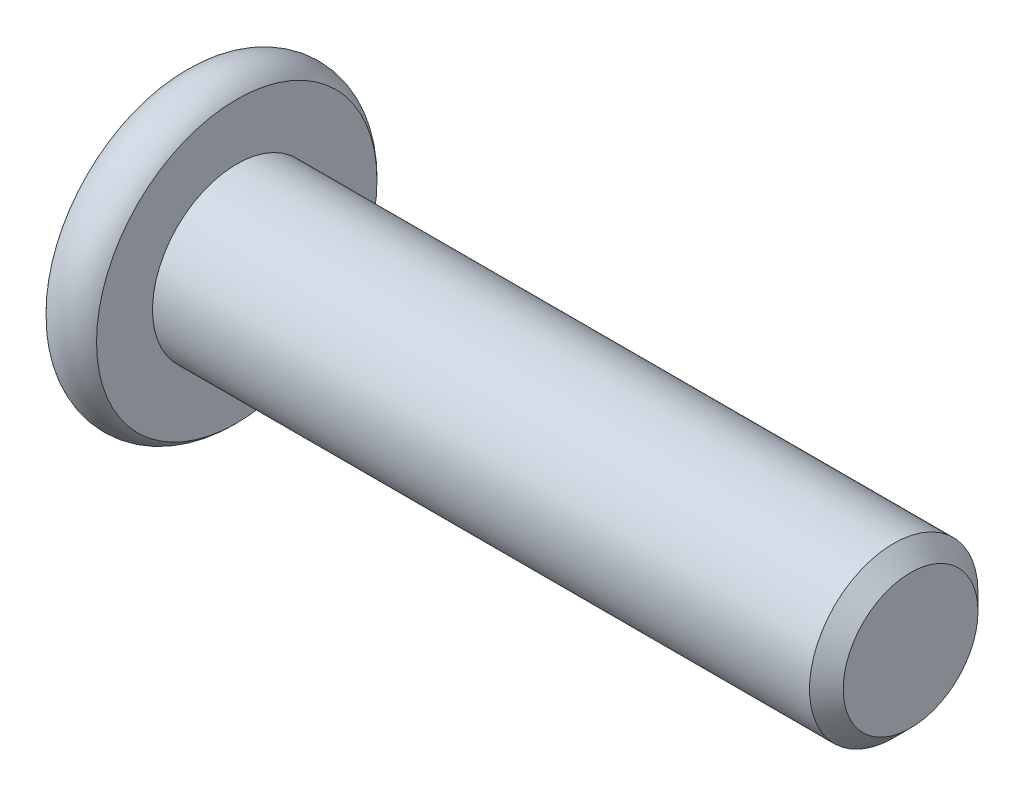
ISO-10303-21;
HEADER;
FILE_DESCRIPTION(('STEP AP214'),'2;1');
FILE_NAME('part.step','',(''),(''),'','','');
FILE_SCHEMA(('AUTOMOTIVE_DESIGN { 1 0 10303 214 1 1 1 1 }'));
ENDSEC;
DATA;
#1=APPLICATION_CONTEXT('core data for automotive mechanical design processes');
#2=APPLICATION_PROTOCOL_DEFINITION('international standard','automotive_design',2000,#1);
#3=PRODUCT_CONTEXT('',#1,'mechanical');
#4=PRODUCT('Part','Part','',(#3));
#5=PRODUCT_RELATED_PRODUCT_CATEGORY('part','',(#4));
#6=PRODUCT_DEFINITION_FORMATION('','',#4);
#7=PRODUCT_DEFINITION_CONTEXT('part definition',#1,'design');
#8=PRODUCT_DEFINITION('design','',#6,#7);
#9=PRODUCT_DEFINITION_SHAPE('','',#8);
#10=(LENGTH_UNIT() NAMED_UNIT(*) SI_UNIT(.MILLI.,.METRE.));
#11=(NAMED_UNIT(*) PLANE_ANGLE_UNIT() SI_UNIT($,.RADIAN.));
#12=(NAMED_UNIT(*) SI_UNIT($,.STERADIAN.) SOLID_ANGLE_UNIT());
#13=UNCERTAINTY_MEASURE_WITH_UNIT(LENGTH_MEASURE(1.E-05),#10,'distance_accuracy_value','');
#14=(GEOMETRIC_REPRESENTATION_CONTEXT(3) GLOBAL_UNCERTAINTY_ASSIGNED_CONTEXT((#13)) GLOBAL_UNIT_ASSIGNED_CONTEXT((#10,
#11,#12)) REPRESENTATION_CONTEXT('',''));
#15=CARTESIAN_POINT('',(0.,0.,0.));
#16=DIRECTION('',(0.,0.,1.));
#17=DIRECTION('',(1.,0.,0.));
#18=AXIS2_PLACEMENT_3D('',#15,#16,#17);
#19=CARTESIAN_POINT('',(-20.,0.,0.));
#20=DIRECTION('',(1.,0.,0.));
#21=DIRECTION('',(0.,0.,-1.));
#22=AXIS2_PLACEMENT_3D('',#19,#20,#21);
#23=CYLINDRICAL_SURFACE('',#22,2.5);
#24=CARTESIAN_POINT('',(-0.5,0.,0.));
#25=DIRECTION('',(1.,0.,0.));
#26=DIRECTION('',(0.,0.,-1.));
#27=AXIS2_PLACEMENT_3D('',#24,#25,#26);
#28=CIRCLE('',#27,2.5);
#29=CARTESIAN_POINT('',(-0.5,0.,-2.5));
#30=VERTEX_POINT('',#29);
#31=EDGE_CURVE('E46',#30,#30,#28,.F.);
#32=ORIENTED_EDGE('',*,*,#31,.T.);
#33=EDGE_LOOP('',(#32));
#34=FACE_BOUND('',#33,.T.);
#35=CARTESIAN_POINT('',(-20.,0.,0.));
#36=DIRECTION('',(-1.,0.,0.));
#37=DIRECTION('',(0.,-1.,0.));
#38=AXIS2_PLACEMENT_3D('',#35,#36,#37);
#39=CIRCLE('',#38,2.5);
#40=CARTESIAN_POINT('',(-20.,-2.50000000000001,0.));
#41=VERTEX_POINT('',#40);
#42=EDGE_CURVE('E122',#41,#41,#39,.F.);
#43=ORIENTED_EDGE('',*,*,#42,.T.);
#44=EDGE_LOOP('',(#43));
#45=FACE_BOUND('',#44,.T.);
#46=ADVANCED_FACE('F33',(#34,#45),#23,.T.);
#47=CARTESIAN_POINT('',(0.,0.,0.));
#48=DIRECTION('',(1.,0.,0.));
#49=DIRECTION('',(0.,0.,-1.));
#50=AXIS2_PLACEMENT_3D('',#47,#48,#49);
#51=PLANE('',#50);
#52=CARTESIAN_POINT('',(0.,0.,0.));
#53=DIRECTION('',(1.,0.,0.));
#54=DIRECTION('',(0.,0.,-1.));
#55=AXIS2_PLACEMENT_3D('',#52,#53,#54);
#56=CIRCLE('',#55,2.);
#57=CARTESIAN_POINT('',(0.,0.,-2.));
#58=VERTEX_POINT('',#57);
#59=EDGE_CURVE('E125',#58,#58,#56,.T.);
#60=ORIENTED_EDGE('',*,*,#59,.T.);
#61=EDGE_LOOP('',(#60));
#62=FACE_BOUND('',#61,.T.);
#63=ADVANCED_FACE('F135',(#62),#51,.T.);
#64=CARTESIAN_POINT('',(0.,0.,0.));
#65=DIRECTION('',(-1.,0.,0.));
#66=DIRECTION('',(0.,0.,1.));
#67=AXIS2_PLACEMENT_3D('',#64,#65,#66);
#68=CONICAL_SURFACE('',#67,2.,0.785398163397446);
#69=ORIENTED_EDGE('',*,*,#31,.F.);
#70=EDGE_LOOP('',(#69));
#71=FACE_BOUND('',#70,.T.);
#72=ORIENTED_EDGE('',*,*,#59,.F.);
#73=EDGE_LOOP('',(#72));
#74=FACE_BOUND('',#73,.T.);
#75=ADVANCED_FACE('F35',(#71,#74),#68,.T.);
#76=CARTESIAN_POINT('',(-21.5,0.,0.));
#77=DIRECTION('',(1.,0.,0.));
#78=DIRECTION('',(0.,1.,0.));
#79=AXIS2_PLACEMENT_3D('',#76,#77,#78);
#80=PLANE('',#79);
#81=CARTESIAN_POINT('',(-21.5,0.,0.));
#82=DIRECTION('',(-1.,0.,0.));
#83=DIRECTION('',(0.,-1.,0.));
#84=AXIS2_PLACEMENT_3D('',#81,#82,#83);
#85=CIRCLE('',#84,1.78205080756886);
#86=CARTESIAN_POINT('',(-21.5,-1.78205080756877,0.));
#87=VERTEX_POINT('',#86);
#88=EDGE_CURVE('E235',#87,#87,#85,.T.);
#89=ORIENTED_EDGE('',*,*,#88,.F.);
#90=EDGE_LOOP('',(#89));
#91=FACE_BOUND('',#90,.T.);
#92=CARTESIAN_POINT('',(-21.5,0.,0.));
#93=DIRECTION('',(-1.,0.,0.));
#94=DIRECTION('',(0.,-1.,0.));
#95=AXIS2_PLACEMENT_3D('',#92,#93,#94);
#96=CIRCLE('',#95,4.16143782776615);
#97=CARTESIAN_POINT('',(-21.5,-4.16143782776614,0.));
#98=VERTEX_POINT('',#97);
#99=EDGE_CURVE('E119',#98,#98,#96,.T.);
#100=ORIENTED_EDGE('',*,*,#99,.T.);
#101=EDGE_LOOP('',(#100));
#102=FACE_BOUND('',#101,.T.);
#103=ADVANCED_FACE('F134',(#91,#102),#80,.F.);
#104=CARTESIAN_POINT('',(-20.75,0.,0.));
#105=DIRECTION('',(-1.,0.,0.));
#106=DIRECTION('',(0.,-1.,0.));
#107=AXIS2_PLACEMENT_3D('',#104,#105,#106);
#108=TOROIDAL_SURFACE('',#107,3.5,1.);
#109=ORIENTED_EDGE('',*,*,#99,.F.);
#110=EDGE_LOOP('',(#109));
#111=FACE_BOUND('',#110,.T.);
#112=CARTESIAN_POINT('',(-20.,0.,0.));
#113=DIRECTION('',(-1.,0.,0.));
#114=DIRECTION('',(0.,-1.,0.));
#115=AXIS2_PLACEMENT_3D('',#112,#113,#114);
#116=CIRCLE('',#115,4.16143782776615);
#117=CARTESIAN_POINT('',(-20.,-4.16143782776615,0.));
#118=VERTEX_POINT('',#117);
#119=EDGE_CURVE('E116',#118,#118,#116,.T.);
#120=ORIENTED_EDGE('',*,*,#119,.T.);
#121=EDGE_LOOP('',(#120));
#122=FACE_BOUND('',#121,.T.);
#123=ADVANCED_FACE('F146',(#111,#122),#108,.T.);
#124=CARTESIAN_POINT('',(-20.,4.16143782776615,0.));
#125=DIRECTION('',(-1.,0.,0.));
#126=DIRECTION('',(0.,-1.,0.));
#127=AXIS2_PLACEMENT_3D('',#124,#125,#126);
#128=PLANE('',#127);
#129=ORIENTED_EDGE('',*,*,#42,.F.);
#130=EDGE_LOOP('',(#129));
#131=FACE_BOUND('',#130,.T.);
#132=ORIENTED_EDGE('',*,*,#119,.F.);
#133=EDGE_LOOP('',(#132));
#134=FACE_BOUND('',#133,.T.);
#135=ADVANCED_FACE('F150',(#131,#134),#128,.F.);
#136=CARTESIAN_POINT('',(-21.5,0.,0.));
#137=DIRECTION('',(-1.,0.,0.));
#138=DIRECTION('',(0.,-1.,0.));
#139=AXIS2_PLACEMENT_3D('',#136,#137,#138);
#140=CONICAL_SURFACE('',#139,1.78205080756886,0.78539816339745);
#141=ORIENTED_EDGE('',*,*,#88,.T.);
#142=EDGE_LOOP('',(#141));
#143=FACE_BOUND('',#142,.T.);
#144=CARTESIAN_POINT('',(-22.015428085613,-1.74023253176573,1.5));
#145=CARTESIAN_POINT('',(-21.9833811073445,-1.69791724929727,1.5));
#146=CARTESIAN_POINT('',(-21.9516444672841,-1.65536760966788,1.5));
#147=CARTESIAN_POINT('',(-21.8889203936153,-1.56970398156681,1.5));
#148=CARTESIAN_POINT('',(-21.85793314822,-1.52658985542845,1.5));
#149=CARTESIAN_POINT('',(-21.765846164345,-1.39562626326559,1.5));
#150=CARTESIAN_POINT('',(-21.7061145123021,-1.30679868010572,1.5));
#151=CARTESIAN_POINT('',(-21.5887342891012,-1.12044622640211,1.5));
#152=CARTESIAN_POINT('',(-21.5314082774823,-1.02271587306669,1.5));
#153=CARTESIAN_POINT('',(-21.426463214976,-0.822357214965219,1.5));
#154=CARTESIAN_POINT('',(-21.3788114236896,-0.719746931701882,1.5));
#155=CARTESIAN_POINT('',(-21.320509988315,-0.565852387095054,1.5));
#156=CARTESIAN_POINT('',(-21.3037990535409,-0.516874191424642,1.5));
#157=CARTESIAN_POINT('',(-21.2743077515089,-0.41772398845748,1.5));
#158=CARTESIAN_POINT('',(-21.2615276514219,-0.367551900263847,1.5));
#159=CARTESIAN_POINT('',(-21.2407784202458,-0.267158299056097,1.5));
#160=CARTESIAN_POINT('',(-21.2327260618259,-0.216954261864833,1.5));
#161=CARTESIAN_POINT('',(-21.221591636834,-0.115994915871297,1.5));
#162=CARTESIAN_POINT('',(-21.2185086886377,-0.0652397064615148,1.5));
#163=CARTESIAN_POINT('',(-21.2175473897404,0.0344222234875812,1.5));
#164=CARTESIAN_POINT('',(-21.2194789216952,0.0833271701101152,1.5));
#165=CARTESIAN_POINT('',(-21.2280175729677,0.180724293127248,1.5));
#166=CARTESIAN_POINT('',(-21.234625142048,0.229216429361756,1.5));
#167=CARTESIAN_POINT('',(-21.2522650626447,0.326258027697034,1.5));
#168=CARTESIAN_POINT('',(-21.263373168201,0.374793507450053,1.5));
#169=CARTESIAN_POINT('',(-21.2894198669595,0.470802295834207,1.5));
#170=CARTESIAN_POINT('',(-21.3043581560035,0.518275688481311,1.5));
#171=CARTESIAN_POINT('',(-21.356839545716,0.667150562065161,1.5));
#172=CARTESIAN_POINT('',(-21.4003351165442,0.766448362426881,1.5));
#173=CARTESIAN_POINT('',(-21.4970587814836,0.960384405673869,1.5));
#174=CARTESIAN_POINT('',(-21.5503217226675,1.05500437383624,1.5));
#175=CARTESIAN_POINT('',(-21.6602258010453,1.23584520321535,1.5));
#176=CARTESIAN_POINT('',(-21.7165682531046,1.32224986946553,1.5));
#177=CARTESIAN_POINT('',(-21.803675572597,1.44954953726477,1.5));
#178=CARTESIAN_POINT('',(-21.8330199906839,1.49143368482427,1.5));
#179=CARTESIAN_POINT('',(-21.8924869182931,1.57462914783248,1.5));
#180=CARTESIAN_POINT('',(-21.9226092115007,1.61594061772583,1.5));
#181=CARTESIAN_POINT('',(-21.9530541181366,1.65701358742556,1.5));
#182=B_SPLINE_CURVE_WITH_KNOTS('',3,(#144,#145,#146,#147,#148,#149,#150,#151,#152,#153,#154,
#155,#156,#157,#158,#159,#160,#161,#162,#163,#164,#165,#166,#167,#168,#169,#170,#171,#172,#173,
#174,#175,#176,#177,#178,#179,#180,#181),.UNSPECIFIED.,.F.,.F.,(4,2,2,2,2,2,2,2,2,2,2,2,2,2,2,2,
2,2,4),(0.,0.159238974218354,0.318517535014543,0.639504781932386,0.979137893799193,
1.31760168934357,1.47272233841624,1.62785352839775,1.78016486537346,1.93244917778279,
2.07904486260297,2.22565464958332,2.37484213303399,2.52401777304039,2.84828365283775,
3.1737297566675,3.48303030530537,3.63644667013909,3.78982082222913),.UNSPECIFIED.);
#183=CARTESIAN_POINT('',(-21.45,-0.866025403784357,1.5));
#184=VERTEX_POINT('',#183);
#185=CARTESIAN_POINT('',(-21.45,0.866025403784521,1.5));
#186=VERTEX_POINT('',#185);
#187=EDGE_CURVE('E100',#184,#186,#182,.T.);
#188=ORIENTED_EDGE('',*,*,#187,.F.);
#189=CARTESIAN_POINT('',(-21.4501154816001,-1.73216627762263,-0.0002000000000008));
#190=CARTESIAN_POINT('',(-21.4203654760674,-1.70239359975907,0.0513677907370744));
#191=CARTESIAN_POINT('',(-21.3923624839103,-1.67212305186347,0.103797917665199));
#192=CARTESIAN_POINT('',(-21.3410892304402,-1.61039789003611,0.210709034055595));
#193=CARTESIAN_POINT('',(-21.3178475050444,-1.57893740312606,0.26520019581466));
#194=CARTESIAN_POINT('',(-21.2780337289922,-1.51549879897979,0.375079081357248));
#195=CARTESIAN_POINT('',(-21.2613615856709,-1.48353684526802,0.430438809095199));
#196=CARTESIAN_POINT('',(-21.2356744568181,-1.41890915196203,0.54237725747715));
#197=CARTESIAN_POINT('',(-21.2266402904789,-1.3862453878111,0.598952556553009));
#198=CARTESIAN_POINT('',(-21.2184890812269,-1.32995210095291,0.696455389516442));
#199=CARTESIAN_POINT('',(-21.2172822529892,-1.30639533311116,0.737256908280467));
#200=CARTESIAN_POINT('',(-21.2193140571623,-1.25932335290185,0.818787969615859));
#201=CARTESIAN_POINT('',(-21.2225536707483,-1.23580815085305,0.859517494314631));
#202=CARTESIAN_POINT('',(-21.233291985982,-1.18900414978418,0.940584402163417));
#203=CARTESIAN_POINT('',(-21.2407946530188,-1.16571558211711,0.980921384598289));
#204=CARTESIAN_POINT('',(-21.2596516119283,-1.11952932016327,1.06091833691403));
#205=CARTESIAN_POINT('',(-21.2710075570186,-1.09663179808778,1.10057800851621));
#206=CARTESIAN_POINT('',(-21.3047216475927,-1.0379815980969,1.20216313477449));
#207=CARTESIAN_POINT('',(-21.3296218490934,-1.00259267147457,1.26345855370969));
#208=CARTESIAN_POINT('',(-21.3716566532716,-0.950557780604292,1.35358562846331));
#209=CARTESIAN_POINT('',(-21.3864251535591,-0.933410759677065,1.38328513990772));
#210=CARTESIAN_POINT('',(-21.4173105659402,-0.899432101996325,1.44213790138375));
#211=CARTESIAN_POINT('',(-21.4334268341217,-0.882600319285629,1.47129140422064));
#212=CARTESIAN_POINT('',(-21.4501154816001,-0.865909933730519,1.5002));
#213=B_SPLINE_CURVE_WITH_KNOTS('',3,(#189,#190,#191,#192,#193,#194,#195,#196,#197,#198,#199,
#200,#201,#202,#203,#204,#205,#206,#207,#208,#209,#210,#211,#212),.UNSPECIFIED.,.F.,.F.,(4,2,2,
2,2,2,2,2,2,2,2,4),(0.,0.199829143693305,0.400822987382389,0.598623720538181,0.795926240188891,
0.937113067959883,1.07833105577193,1.21968061668222,1.36109089931055,1.58570969637566,
1.69770705470964,1.80965120737194),.UNSPECIFIED.);
#214=CARTESIAN_POINT('',(-21.45,-1.73205080756879,0.));
#215=VERTEX_POINT('',#214);
#216=EDGE_CURVE('E192',#215,#184,#213,.T.);
#217=ORIENTED_EDGE('',*,*,#216,.F.);
#218=CARTESIAN_POINT('',(-21.4501154816001,-0.865909933730519,-1.5002));
#219=CARTESIAN_POINT('',(-21.4203654760674,-0.895682611594084,-1.44863220926292));
#220=CARTESIAN_POINT('',(-21.3923624839103,-0.925953159489683,-1.3962020823348));
#221=CARTESIAN_POINT('',(-21.3410892304402,-0.987678321317041,-1.2892909659444));
#222=CARTESIAN_POINT('',(-21.3178475050444,-1.01913880822709,-1.23479980418534));
#223=CARTESIAN_POINT('',(-21.2780337289922,-1.08257741237336,-1.12492091864275));
#224=CARTESIAN_POINT('',(-21.2613615856709,-1.11453936608513,-1.0695611909048));
#225=CARTESIAN_POINT('',(-21.2356744568181,-1.17916705939112,-0.957622742522851));
#226=CARTESIAN_POINT('',(-21.2266402904789,-1.21183082354205,-0.901047443446993));
#227=CARTESIAN_POINT('',(-21.2184890812269,-1.26812411040024,-0.80354461048356));
#228=CARTESIAN_POINT('',(-21.2172822529892,-1.291680878242,-0.762743091719535));
#229=CARTESIAN_POINT('',(-21.2193140571623,-1.3387528584513,-0.681212030384143));
#230=CARTESIAN_POINT('',(-21.2225536707483,-1.3622680605001,-0.640482505685371));
#231=CARTESIAN_POINT('',(-21.233291985982,-1.40907206156897,-0.559415597836585));
#232=CARTESIAN_POINT('',(-21.2407946530188,-1.43236062923604,-0.519078615401714));
#233=CARTESIAN_POINT('',(-21.2596516119283,-1.47854689118988,-0.439081663085971));
#234=CARTESIAN_POINT('',(-21.2710075570186,-1.50144441326537,-0.399421991483794));
#235=CARTESIAN_POINT('',(-21.3047216475927,-1.56009461325625,-0.297836865225517));
#236=CARTESIAN_POINT('',(-21.3296218490934,-1.59548353987858,-0.236541446290313));
#237=CARTESIAN_POINT('',(-21.3716566532716,-1.64751843074886,-0.146414371536688));
#238=CARTESIAN_POINT('',(-21.3864251535591,-1.66466545167609,-0.116714860092285));
#239=CARTESIAN_POINT('',(-21.4173105659402,-1.69864410935683,-0.0578620986162509));
#240=CARTESIAN_POINT('',(-21.4334268341217,-1.71547589206752,-0.0287085957793639));
#241=CARTESIAN_POINT('',(-21.4501154816001,-1.73216627762263,0.00019999999999943));
#242=B_SPLINE_CURVE_WITH_KNOTS('',3,(#218,#219,#220,#221,#222,#223,#224,#225,#226,#227,#228,
#229,#230,#231,#232,#233,#234,#235,#236,#237,#238,#239,#240,#241),.UNSPECIFIED.,.F.,.F.,(4,2,2,
2,2,2,2,2,2,2,2,4),(0.,0.199829143693304,0.400822987382386,0.598623720538178,0.795926240188888,
0.937113067959879,1.07833105577193,1.21968061668222,1.36109089931054,1.58570969637565,
1.69770705470963,1.80965120737194),.UNSPECIFIED.);
#243=CARTESIAN_POINT('',(-21.45,-0.866025403784356,-1.5));
#244=VERTEX_POINT('',#243);
#245=EDGE_CURVE('E187',#244,#215,#242,.T.);
#246=ORIENTED_EDGE('',*,*,#245,.F.);
#247=CARTESIAN_POINT('',(-22.0154280857208,-1.74023253190806,-1.5));
#248=CARTESIAN_POINT('',(-21.9833811074482,-1.69791724943558,-1.5));
#249=CARTESIAN_POINT('',(-21.9516444673836,-1.65536760980217,-1.5));
#250=CARTESIAN_POINT('',(-21.8889203937065,-1.569703981693,-1.5));
#251=CARTESIAN_POINT('',(-21.8579331483071,-1.52658985555058,-1.5));
#252=CARTESIAN_POINT('',(-21.7658461644196,-1.39562626337528,-1.5));
#253=CARTESIAN_POINT('',(-21.7061145123685,-1.30679868020694,-1.5));
#254=CARTESIAN_POINT('',(-21.5887342891506,-1.12044622648488,-1.5));
#255=CARTESIAN_POINT('',(-21.5314082775229,-1.02271587313942,-1.5));
#256=CARTESIAN_POINT('',(-21.4264632150005,-0.822357215017008,-1.5));
#257=CARTESIAN_POINT('',(-21.3788114237068,-0.719746931742781,-1.5));
#258=CARTESIAN_POINT('',(-21.3205099883267,-0.565852387127772,-1.5));
#259=CARTESIAN_POINT('',(-21.3037990535528,-0.516874191460807,-1.5));
#260=CARTESIAN_POINT('',(-21.2743077515206,-0.417723988500656,-1.5));
#261=CARTESIAN_POINT('',(-21.2615276514332,-0.367551900310585,-1.5));
#262=CARTESIAN_POINT('',(-21.2407784202553,-0.267158299109846,-1.5));
#263=CARTESIAN_POINT('',(-21.2327260618343,-0.216954261922027,-1.5));
#264=CARTESIAN_POINT('',(-21.2215916368391,-0.11599491593527,-1.5));
#265=CARTESIAN_POINT('',(-21.2185086886407,-0.0652397065288216,-1.5));
#266=CARTESIAN_POINT('',(-21.2175473897388,0.0344222234142057,-1.5));
#267=CARTESIAN_POINT('',(-21.219478921691,0.0833271700339959,-1.5));
#268=CARTESIAN_POINT('',(-21.228017572958,0.18072429304592,-1.5));
#269=CARTESIAN_POINT('',(-21.2346251420354,0.229216429277964,-1.5));
#270=CARTESIAN_POINT('',(-21.2522650626259,0.326258027608378,-1.5));
#271=CARTESIAN_POINT('',(-21.2633731681789,0.374793507359005,-1.5));
#272=CARTESIAN_POINT('',(-21.2894198669309,0.470802295738608,-1.5));
#273=CARTESIAN_POINT('',(-21.3043581559716,0.518275688383553,-1.5));
#274=CARTESIAN_POINT('',(-21.3568395456685,0.667150561946207,-1.5));
#275=CARTESIAN_POINT('',(-21.4003351164824,0.766448362289951,-1.5));
#276=CARTESIAN_POINT('',(-21.4970587813916,0.960384405502367,-1.5));
#277=CARTESIAN_POINT('',(-21.5503217225595,1.05500437364815,-1.5));
#278=CARTESIAN_POINT('',(-21.6602258009069,1.23584520299745,-1.5));
#279=CARTESIAN_POINT('',(-21.7165682529518,1.32224986923429,-1.5));
#280=CARTESIAN_POINT('',(-21.8036755724226,1.44954953701381,-1.5));
#281=CARTESIAN_POINT('',(-21.8330199905024,1.49143368456684,-1.5));
#282=CARTESIAN_POINT('',(-21.8924869180973,1.57462914756214,-1.5));
#283=CARTESIAN_POINT('',(-21.9226092112979,1.61594061744905,-1.5));
#284=CARTESIAN_POINT('',(-21.9530541179266,1.65701358714236,-1.5));
#285=B_SPLINE_CURVE_WITH_KNOTS('',3,(#247,#248,#249,#250,#251,#252,#253,#254,#255,#256,#257,
#258,#259,#260,#261,#262,#263,#264,#265,#266,#267,#268,#269,#270,#271,#272,#273,#274,#275,#276,
#277,#278,#279,#280,#281,#282,#283,#284),.UNSPECIFIED.,.F.,.F.,(4,2,2,2,2,2,2,2,2,2,2,2,2,2,2,2,
2,2,4),(0.,0.159238974235481,0.318517535048797,0.63950478200154,0.979137893907506,
1.31760168949067,1.47272233855334,1.62785352852489,1.78016486549104,1.93244917789081,
2.0790448627025,2.22565464967435,2.37484213311584,2.52401777311309,2.8482836528441,
3.17372975660706,3.4830303051878,3.63644666999334,3.78982082205521),.UNSPECIFIED.);
#286=CARTESIAN_POINT('',(-21.45,0.866025403784521,-1.5));
#287=VERTEX_POINT('',#286);
#288=EDGE_CURVE('E53',#287,#244,#285,.F.);
#289=ORIENTED_EDGE('',*,*,#288,.F.);
#290=CARTESIAN_POINT('',(-21.4501154816001,1.7321662776228,0.00020000000000003));
#291=CARTESIAN_POINT('',(-21.4203654760673,1.70239359975923,-0.0513677907370759));
#292=CARTESIAN_POINT('',(-21.3923624839103,1.67212305186363,-0.103797917665201));
#293=CARTESIAN_POINT('',(-21.3410892304402,1.61039789003627,-0.210709034055597));
#294=CARTESIAN_POINT('',(-21.3178475050444,1.57893740312622,-0.265200195814661));
#295=CARTESIAN_POINT('',(-21.2780337289922,1.51549879897995,-0.375079081357247));
#296=CARTESIAN_POINT('',(-21.2613615856709,1.48353684526818,-0.430438809095198));
#297=CARTESIAN_POINT('',(-21.2356744568181,1.4189091519622,-0.542377257477149));
#298=CARTESIAN_POINT('',(-21.2266402904789,1.38624538781127,-0.598952556553007));
#299=CARTESIAN_POINT('',(-21.2184890812269,1.32995210095308,-0.696455389516439));
#300=CARTESIAN_POINT('',(-21.2172822529892,1.30639533311132,-0.737256908280464));
#301=CARTESIAN_POINT('',(-21.2193140571623,1.25932335290202,-0.818787969615856));
#302=CARTESIAN_POINT('',(-21.2225536707483,1.23580815085322,-0.859517494314628));
#303=CARTESIAN_POINT('',(-21.233291985982,1.18900414978435,-0.940584402163414));
#304=CARTESIAN_POINT('',(-21.2407946530187,1.16571558211728,-0.980921384598287));
#305=CARTESIAN_POINT('',(-21.2596516119283,1.11952932016343,-1.06091833691403));
#306=CARTESIAN_POINT('',(-21.2710075570186,1.09663179808795,-1.10057800851621));
#307=CARTESIAN_POINT('',(-21.3047216475927,1.03798159809707,-1.20216313477448));
#308=CARTESIAN_POINT('',(-21.3296218490934,1.00259267147474,-1.26345855370969));
#309=CARTESIAN_POINT('',(-21.3716566532716,0.950557780604457,-1.35358562846331));
#310=CARTESIAN_POINT('',(-21.3864251535591,0.93341075967723,-1.38328513990772));
#311=CARTESIAN_POINT('',(-21.4173105659402,0.89943210199649,-1.44213790138375));
#312=CARTESIAN_POINT('',(-21.4334268341217,0.882600319285793,-1.47129140422064));
#313=CARTESIAN_POINT('',(-21.4501154816001,0.865909933730683,-1.5002));
#314=B_SPLINE_CURVE_WITH_KNOTS('',3,(#290,#291,#292,#293,#294,#295,#296,#297,#298,#299,#300,
#301,#302,#303,#304,#305,#306,#307,#308,#309,#310,#311,#312,#313),.UNSPECIFIED.,.F.,.F.,(4,2,2,
2,2,2,2,2,2,2,2,4),(0.,0.199829143693305,0.400822987382387,0.598623720538179,0.795926240188887,
0.937113067959879,1.07833105577193,1.21968061668222,1.36109089931054,1.58570969637565,
1.69770705470963,1.80965120737194),.UNSPECIFIED.);
#315=CARTESIAN_POINT('',(-21.45,1.73205080756896,0.));
#316=VERTEX_POINT('',#315);
#317=EDGE_CURVE('E11',#316,#287,#314,.T.);
#318=ORIENTED_EDGE('',*,*,#317,.F.);
#319=CARTESIAN_POINT('',(-21.4501154816001,0.865909933730683,1.5002));
#320=CARTESIAN_POINT('',(-21.4203654760673,0.895682611594248,1.44863220926292));
#321=CARTESIAN_POINT('',(-21.3923624839103,0.925953159489847,1.3962020823348));
#322=CARTESIAN_POINT('',(-21.3410892304402,0.987678321317206,1.2892909659444));
#323=CARTESIAN_POINT('',(-21.3178475050444,1.01913880822726,1.23479980418534));
#324=CARTESIAN_POINT('',(-21.2780337289922,1.08257741237353,1.12492091864275));
#325=CARTESIAN_POINT('',(-21.2613615856709,1.1145393660853,1.0695611909048));
#326=CARTESIAN_POINT('',(-21.2356744568181,1.17916705939129,0.957622742522847));
#327=CARTESIAN_POINT('',(-21.2266402904789,1.21183082354222,0.901047443446989));
#328=CARTESIAN_POINT('',(-21.2184890812269,1.2681241104004,0.803544610483557));
#329=CARTESIAN_POINT('',(-21.2172822529892,1.29168087824216,0.762743091719531));
#330=CARTESIAN_POINT('',(-21.2193140571623,1.33875285845146,0.681212030384139));
#331=CARTESIAN_POINT('',(-21.2225536707483,1.36226806050027,0.640482505685368));
#332=CARTESIAN_POINT('',(-21.233291985982,1.40907206156913,0.559415597836582));
#333=CARTESIAN_POINT('',(-21.2407946530187,1.4323606292362,0.51907861540171));
#334=CARTESIAN_POINT('',(-21.2596516119283,1.47854689119005,0.439081663085967));
#335=CARTESIAN_POINT('',(-21.2710075570186,1.50144441326554,0.39942199148379));
#336=CARTESIAN_POINT('',(-21.3047216475927,1.56009461325641,0.297836865225514));
#337=CARTESIAN_POINT('',(-21.3296218490934,1.59548353987875,0.23654144629031));
#338=CARTESIAN_POINT('',(-21.3716566532716,1.64751843074902,0.146414371536686));
#339=CARTESIAN_POINT('',(-21.3864251535591,1.66466545167625,0.116714860092283));
#340=CARTESIAN_POINT('',(-21.4173105659402,1.69864410935699,0.05786209861625));
#341=CARTESIAN_POINT('',(-21.4334268341217,1.71547589206769,0.0287085957793637));
#342=CARTESIAN_POINT('',(-21.4501154816001,1.7321662776228,-0.000199999999999372));
#343=B_SPLINE_CURVE_WITH_KNOTS('',3,(#319,#320,#321,#322,#323,#324,#325,#326,#327,#328,#329,
#330,#331,#332,#333,#334,#335,#336,#337,#338,#339,#340,#341,#342),.UNSPECIFIED.,.F.,.F.,(4,2,2,
2,2,2,2,2,2,2,2,4),(0.,0.199829143693306,0.40082298738239,0.598623720538183,0.795926240188891,
0.937113067959883,1.07833105577193,1.21968061668222,1.36109089931055,1.58570969637565,
1.69770705470963,1.80965120737193),.UNSPECIFIED.);
#344=EDGE_CURVE('E91',#186,#316,#343,.T.);
#345=ORIENTED_EDGE('',*,*,#344,.F.);
#346=EDGE_LOOP('',(#188,#217,#246,#289,#318,#345));
#347=FACE_BOUND('',#346,.T.);
#348=ADVANCED_FACE('F90',(#143,#347),#140,.F.);
#349=CARTESIAN_POINT('',(-19.2,0.,0.));
#350=DIRECTION('',(-1.,0.,0.));
#351=DIRECTION('',(0.,-1.,0.));
#352=AXIS2_PLACEMENT_3D('',#349,#350,#351);
#353=PLANE('',#352);
#354=DIRECTION('',(0.,0.5,-0.866025403784438));
#355=VECTOR('',#354,1.);
#356=CARTESIAN_POINT('',(-19.2,0.866025403784512,1.5));
#357=LINE('',#356,#355);
#358=CARTESIAN_POINT('',(-19.2,0.866025403784512,1.5));
#359=VERTEX_POINT('',#358);
#360=CARTESIAN_POINT('',(-19.2,1.73205080756895,0.));
#361=VERTEX_POINT('',#360);
#362=EDGE_CURVE('E99',#359,#361,#357,.T.);
#363=ORIENTED_EDGE('',*,*,#362,.T.);
#364=DIRECTION('',(0.,-0.5,-0.866025403784439));
#365=VECTOR('',#364,1.);
#366=CARTESIAN_POINT('',(-19.2,1.73205080756895,0.));
#367=LINE('',#366,#365);
#368=CARTESIAN_POINT('',(-19.2,0.866025403784512,-1.5));
#369=VERTEX_POINT('',#368);
#370=EDGE_CURVE('E104',#361,#369,#367,.T.);
#371=ORIENTED_EDGE('',*,*,#370,.T.);
#372=DIRECTION('',(0.,-1.,0.));
#373=VECTOR('',#372,1.);
#374=CARTESIAN_POINT('',(-19.2,0.866025403784512,-1.5));
#375=LINE('',#374,#373);
#376=CARTESIAN_POINT('',(-19.2,-0.866025403784365,-1.5));
#377=VERTEX_POINT('',#376);
#378=EDGE_CURVE('E217',#369,#377,#375,.T.);
#379=ORIENTED_EDGE('',*,*,#378,.T.);
#380=DIRECTION('',(0.,-0.5,0.866025403784439));
#381=VECTOR('',#380,1.);
#382=CARTESIAN_POINT('',(-19.2,-0.866025403784365,-1.5));
#383=LINE('',#382,#381);
#384=CARTESIAN_POINT('',(-19.2,-1.7320508075688,0.));
#385=VERTEX_POINT('',#384);
#386=EDGE_CURVE('E221',#377,#385,#383,.T.);
#387=ORIENTED_EDGE('',*,*,#386,.T.);
#388=DIRECTION('',(0.,0.5,0.866025403784439));
#389=VECTOR('',#388,1.);
#390=CARTESIAN_POINT('',(-19.2,-1.7320508075688,0.));
#391=LINE('',#390,#389);
#392=CARTESIAN_POINT('',(-19.2,-0.866025403784366,1.5));
#393=VERTEX_POINT('',#392);
#394=EDGE_CURVE('E112',#385,#393,#391,.T.);
#395=ORIENTED_EDGE('',*,*,#394,.T.);
#396=DIRECTION('',(0.,1.,0.));
#397=VECTOR('',#396,1.);
#398=CARTESIAN_POINT('',(-19.2,-0.866025403784366,1.5));
#399=LINE('',#398,#397);
#400=EDGE_CURVE('E107',#393,#359,#399,.T.);
#401=ORIENTED_EDGE('',*,*,#400,.T.);
#402=EDGE_LOOP('',(#363,#371,#379,#387,#395,#401));
#403=FACE_BOUND('',#402,.T.);
#404=ADVANCED_FACE('F174',(#403),#353,.T.);
#405=CARTESIAN_POINT('',(-19.2,1.73205080756895,0.));
#406=DIRECTION('',(0.,0.866025403784439,-0.5));
#407=DIRECTION('',(0.,0.5,0.866025403784439));
#408=AXIS2_PLACEMENT_3D('',#405,#406,#407);
#409=PLANE('',#408);
#410=DIRECTION('',(-1.,0.,0.));
#411=VECTOR('',#410,1.);
#412=CARTESIAN_POINT('',(-19.2,1.73205080756895,0.));
#413=LINE('',#412,#411);
#414=EDGE_CURVE('E97',#361,#316,#413,.T.);
#415=ORIENTED_EDGE('',*,*,#414,.T.);
#416=ORIENTED_EDGE('',*,*,#317,.T.);
#417=DIRECTION('',(-1.,0.,0.));
#418=VECTOR('',#417,1.);
#419=CARTESIAN_POINT('',(-19.2,0.866025403784512,-1.5));
#420=LINE('',#419,#418);
#421=EDGE_CURVE('E106',#369,#287,#420,.T.);
#422=ORIENTED_EDGE('',*,*,#421,.F.);
#423=ORIENTED_EDGE('',*,*,#370,.F.);
#424=EDGE_LOOP('',(#415,#416,#422,#423));
#425=FACE_BOUND('',#424,.T.);
#426=ADVANCED_FACE('F102',(#425),#409,.F.);
#427=CARTESIAN_POINT('',(-19.2,0.866025403784512,-1.5));
#428=DIRECTION('',(0.,0.,-1.));
#429=DIRECTION('',(0.,1.,0.));
#430=AXIS2_PLACEMENT_3D('',#427,#428,#429);
#431=PLANE('',#430);
#432=ORIENTED_EDGE('',*,*,#421,.T.);
#433=ORIENTED_EDGE('',*,*,#288,.T.);
#434=DIRECTION('',(-1.,0.,0.));
#435=VECTOR('',#434,1.);
#436=CARTESIAN_POINT('',(-19.2,-0.866025403784365,-1.5));
#437=LINE('',#436,#435);
#438=EDGE_CURVE('E109',#377,#244,#437,.T.);
#439=ORIENTED_EDGE('',*,*,#438,.F.);
#440=ORIENTED_EDGE('',*,*,#378,.F.);
#441=EDGE_LOOP('',(#432,#433,#439,#440));
#442=FACE_BOUND('',#441,.T.);
#443=ADVANCED_FACE('F206',(#442),#431,.F.);
#444=CARTESIAN_POINT('',(-19.2,-0.866025403784365,-1.5));
#445=DIRECTION('',(0.,-0.866025403784439,-0.5));
#446=DIRECTION('',(0.,0.5,-0.866025403784439));
#447=AXIS2_PLACEMENT_3D('',#444,#445,#446);
#448=PLANE('',#447);
#449=ORIENTED_EDGE('',*,*,#438,.T.);
#450=ORIENTED_EDGE('',*,*,#245,.T.);
#451=DIRECTION('',(-1.,0.,0.));
#452=VECTOR('',#451,1.);
#453=CARTESIAN_POINT('',(-19.2,-1.7320508075688,0.));
#454=LINE('',#453,#452);
#455=EDGE_CURVE('E231',#385,#215,#454,.T.);
#456=ORIENTED_EDGE('',*,*,#455,.F.);
#457=ORIENTED_EDGE('',*,*,#386,.F.);
#458=EDGE_LOOP('',(#449,#450,#456,#457));
#459=FACE_BOUND('',#458,.T.);
#460=ADVANCED_FACE('F201',(#459),#448,.F.);
#461=CARTESIAN_POINT('',(-19.2,-1.7320508075688,0.));
#462=DIRECTION('',(0.,-0.866025403784439,0.5));
#463=DIRECTION('',(0.,-0.5,-0.866025403784439));
#464=AXIS2_PLACEMENT_3D('',#461,#462,#463);
#465=PLANE('',#464);
#466=ORIENTED_EDGE('',*,*,#455,.T.);
#467=ORIENTED_EDGE('',*,*,#216,.T.);
#468=DIRECTION('',(-1.,0.,0.));
#469=VECTOR('',#468,1.);
#470=CARTESIAN_POINT('',(-19.2,-0.866025403784366,1.5));
#471=LINE('',#470,#469);
#472=EDGE_CURVE('E228',#393,#184,#471,.T.);
#473=ORIENTED_EDGE('',*,*,#472,.F.);
#474=ORIENTED_EDGE('',*,*,#394,.F.);
#475=EDGE_LOOP('',(#466,#467,#473,#474));
#476=FACE_BOUND('',#475,.T.);
#477=ADVANCED_FACE('F198',(#476),#465,.F.);
#478=CARTESIAN_POINT('',(-19.2,-0.866025403784366,1.5));
#479=DIRECTION('',(0.,0.,1.));
#480=DIRECTION('',(1.,0.,0.));
#481=AXIS2_PLACEMENT_3D('',#478,#479,#480);
#482=PLANE('',#481);
#483=ORIENTED_EDGE('',*,*,#472,.T.);
#484=ORIENTED_EDGE('',*,*,#187,.T.);
#485=DIRECTION('',(-1.,0.,0.));
#486=VECTOR('',#485,1.);
#487=CARTESIAN_POINT('',(-19.2,0.866025403784512,1.5));
#488=LINE('',#487,#486);
#489=EDGE_CURVE('E60',#359,#186,#488,.T.);
#490=ORIENTED_EDGE('',*,*,#489,.F.);
#491=ORIENTED_EDGE('',*,*,#400,.F.);
#492=EDGE_LOOP('',(#483,#484,#490,#491));
#493=FACE_BOUND('',#492,.T.);
#494=ADVANCED_FACE('F157',(#493),#482,.F.);
#495=CARTESIAN_POINT('',(-19.2,0.866025403784512,1.5));
#496=DIRECTION('',(0.,0.866025403784439,0.5));
#497=DIRECTION('',(0.,-0.5,0.866025403784439));
#498=AXIS2_PLACEMENT_3D('',#495,#496,#497);
#499=PLANE('',#498);
#500=ORIENTED_EDGE('',*,*,#489,.T.);
#501=ORIENTED_EDGE('',*,*,#344,.T.);
#502=ORIENTED_EDGE('',*,*,#414,.F.);
#503=ORIENTED_EDGE('',*,*,#362,.F.);
#504=EDGE_LOOP('',(#500,#501,#502,#503));
#505=FACE_BOUND('',#504,.T.);
#506=ADVANCED_FACE('F96',(#505),#499,.F.);
#507=CLOSED_SHELL('',(#46,#63,#75,#103,#123,#135,#348,#404,#426,#443,#460,#477,#494,#506));
#508=MANIFOLD_SOLID_BREP('B2',#507);
#509=ADVANCED_BREP_SHAPE_REPRESENTATION('',(#18,#508),#14);
#510=SHAPE_DEFINITION_REPRESENTATION(#9,#509);
ENDSEC;
END-ISO-10303-21;
